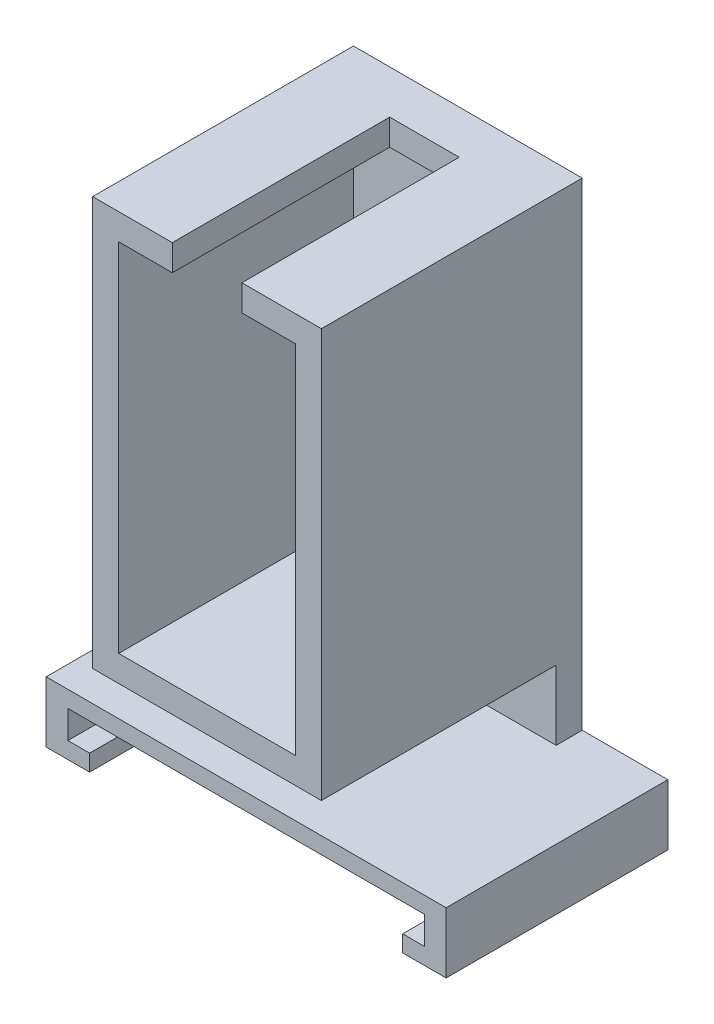
ISO-10303-21;
HEADER;
FILE_DESCRIPTION(('STEP AP214'),'2;1');
FILE_NAME('part.step','',(''),(''),'','','');
FILE_SCHEMA(('AUTOMOTIVE_DESIGN { 1 0 10303 214 1 1 1 1 }'));
ENDSEC;
DATA;
#1=APPLICATION_CONTEXT('core data for automotive mechanical design processes');
#2=APPLICATION_PROTOCOL_DEFINITION('international standard','automotive_design',2000,#1);
#3=PRODUCT_CONTEXT('',#1,'mechanical');
#4=PRODUCT('Part','Part','',(#3));
#5=PRODUCT_RELATED_PRODUCT_CATEGORY('part','',(#4));
#6=PRODUCT_DEFINITION_FORMATION('','',#4);
#7=PRODUCT_DEFINITION_CONTEXT('part definition',#1,'design');
#8=PRODUCT_DEFINITION('design','',#6,#7);
#9=PRODUCT_DEFINITION_SHAPE('','',#8);
#10=(LENGTH_UNIT() NAMED_UNIT(*) SI_UNIT(.MILLI.,.METRE.));
#11=(NAMED_UNIT(*) PLANE_ANGLE_UNIT() SI_UNIT($,.RADIAN.));
#12=(NAMED_UNIT(*) SI_UNIT($,.STERADIAN.) SOLID_ANGLE_UNIT());
#13=UNCERTAINTY_MEASURE_WITH_UNIT(LENGTH_MEASURE(1.E-05),#10,'distance_accuracy_value','');
#14=(GEOMETRIC_REPRESENTATION_CONTEXT(3) GLOBAL_UNCERTAINTY_ASSIGNED_CONTEXT((#13)) GLOBAL_UNIT_ASSIGNED_CONTEXT((#10,
#11,#12)) REPRESENTATION_CONTEXT('',''));
#15=CARTESIAN_POINT('',(0.,0.,0.));
#16=DIRECTION('',(0.,0.,1.));
#17=DIRECTION('',(1.,0.,0.));
#18=AXIS2_PLACEMENT_3D('',#15,#16,#17);
#19=CARTESIAN_POINT('',(0.,-33.4,5.5));
#20=DIRECTION('',(0.,-1.,0.));
#21=DIRECTION('',(0.,0.,-1.));
#22=AXIS2_PLACEMENT_3D('',#19,#20,#21);
#23=PLANE('',#22);
#24=DIRECTION('',(1.,0.,0.));
#25=VECTOR('',#24,1.);
#26=CARTESIAN_POINT('',(23.,-33.4,3.));
#27=LINE('',#26,#25);
#28=CARTESIAN_POINT('',(-20.5,-33.4,3.));
#29=VERTEX_POINT('',#28);
#30=CARTESIAN_POINT('',(20.5,-33.4,3.));
#31=VERTEX_POINT('',#30);
#32=EDGE_CURVE('E428',#29,#31,#27,.T.);
#33=ORIENTED_EDGE('',*,*,#32,.T.);
#34=DIRECTION('',(0.,0.,-1.));
#35=VECTOR('',#34,1.);
#36=CARTESIAN_POINT('',(20.5,-33.4,5.5));
#37=LINE('',#36,#35);
#38=CARTESIAN_POINT('',(20.5,-33.4,25.5));
#39=VERTEX_POINT('',#38);
#40=EDGE_CURVE('E387',#39,#31,#37,.T.);
#41=ORIENTED_EDGE('',*,*,#40,.F.);
#42=DIRECTION('',(1.,0.,0.));
#43=VECTOR('',#42,1.);
#44=CARTESIAN_POINT('',(0.,-33.4,25.5));
#45=LINE('',#44,#43);
#46=CARTESIAN_POINT('',(-20.5,-33.4,25.5));
#47=VERTEX_POINT('',#46);
#48=EDGE_CURVE('E361',#47,#39,#45,.T.);
#49=ORIENTED_EDGE('',*,*,#48,.F.);
#50=DIRECTION('',(0.,0.,-1.));
#51=VECTOR('',#50,1.);
#52=CARTESIAN_POINT('',(-20.5,-33.4,5.5));
#53=LINE('',#52,#51);
#54=EDGE_CURVE('E391',#47,#29,#53,.T.);
#55=ORIENTED_EDGE('',*,*,#54,.T.);
#56=EDGE_LOOP('',(#33,#41,#49,#55));
#57=FACE_BOUND('',#56,.T.);
#58=ADVANCED_FACE('F106',(#57),#23,.T.);
#59=CARTESIAN_POINT('',(0.,0.,3.));
#60=DIRECTION('',(0.,0.,-1.));
#61=DIRECTION('',(-1.,0.,0.));
#62=AXIS2_PLACEMENT_3D('',#59,#60,#61);
#63=PLANE('',#62);
#64=DIRECTION('',(0.,-1.,0.));
#65=VECTOR('',#64,1.);
#66=CARTESIAN_POINT('',(20.5,-36.6,3.));
#67=LINE('',#66,#65);
#68=CARTESIAN_POINT('',(20.5,-36.6,3.));
#69=VERTEX_POINT('',#68);
#70=EDGE_CURVE('E360',#31,#69,#67,.T.);
#71=ORIENTED_EDGE('',*,*,#70,.F.);
#72=ORIENTED_EDGE('',*,*,#32,.F.);
#73=DIRECTION('',(0.,1.,0.));
#74=VECTOR('',#73,1.);
#75=CARTESIAN_POINT('',(-20.5,-33.4,3.));
#76=LINE('',#75,#74);
#77=CARTESIAN_POINT('',(-20.5,-36.6,3.));
#78=VERTEX_POINT('',#77);
#79=EDGE_CURVE('E389',#78,#29,#76,.T.);
#80=ORIENTED_EDGE('',*,*,#79,.F.);
#81=DIRECTION('',(-1.,0.,0.));
#82=VECTOR('',#81,1.);
#83=CARTESIAN_POINT('',(23.,-36.6,3.));
#84=LINE('',#83,#82);
#85=EDGE_CURVE('E424',#69,#78,#84,.T.);
#86=ORIENTED_EDGE('',*,*,#85,.F.);
#87=EDGE_LOOP('',(#71,#72,#80,#86));
#88=FACE_BOUND('',#87,.T.);
#89=ADVANCED_FACE('F571',(#88),#63,.F.);
#90=CARTESIAN_POINT('',(0.,-36.6,5.5));
#91=DIRECTION('',(0.,-1.,0.));
#92=DIRECTION('',(0.,0.,-1.));
#93=AXIS2_PLACEMENT_3D('',#90,#91,#92);
#94=PLANE('',#93);
#95=DIRECTION('',(0.,0.,-1.));
#96=VECTOR('',#95,1.);
#97=CARTESIAN_POINT('',(20.5,-36.6,5.5));
#98=LINE('',#97,#96);
#99=CARTESIAN_POINT('',(20.5,-36.6,25.5));
#100=VERTEX_POINT('',#99);
#101=EDGE_CURVE('E384',#100,#69,#98,.T.);
#102=ORIENTED_EDGE('',*,*,#101,.T.);
#103=ORIENTED_EDGE('',*,*,#85,.T.);
#104=DIRECTION('',(0.,0.,-1.));
#105=VECTOR('',#104,1.);
#106=CARTESIAN_POINT('',(-20.5,-36.6,5.5));
#107=LINE('',#106,#105);
#108=CARTESIAN_POINT('',(-20.5,-36.6,25.5));
#109=VERTEX_POINT('',#108);
#110=EDGE_CURVE('E394',#109,#78,#107,.T.);
#111=ORIENTED_EDGE('',*,*,#110,.F.);
#112=DIRECTION('',(-1.,0.,0.));
#113=VECTOR('',#112,1.);
#114=CARTESIAN_POINT('',(0.,-36.6,25.5));
#115=LINE('',#114,#113);
#116=CARTESIAN_POINT('',(-18.,-36.6,25.5));
#117=VERTEX_POINT('',#116);
#118=EDGE_CURVE('E352',#117,#109,#115,.T.);
#119=ORIENTED_EDGE('',*,*,#118,.F.);
#120=DIRECTION('',(0.,0.,-1.));
#121=VECTOR('',#120,1.);
#122=CARTESIAN_POINT('',(-18.,-36.6,25.5));
#123=LINE('',#122,#121);
#124=CARTESIAN_POINT('',(-18.,-36.6,5.5));
#125=VERTEX_POINT('',#124);
#126=EDGE_CURVE('E355',#117,#125,#123,.T.);
#127=ORIENTED_EDGE('',*,*,#126,.T.);
#128=DIRECTION('',(-1.,0.,0.));
#129=VECTOR('',#128,1.);
#130=CARTESIAN_POINT('',(0.,-36.6,5.5));
#131=LINE('',#130,#129);
#132=CARTESIAN_POINT('',(18.,-36.6,5.5));
#133=VERTEX_POINT('',#132);
#134=EDGE_CURVE('E412',#133,#125,#131,.T.);
#135=ORIENTED_EDGE('',*,*,#134,.F.);
#136=DIRECTION('',(0.,0.,-1.));
#137=VECTOR('',#136,1.);
#138=CARTESIAN_POINT('',(18.,-36.6,25.5));
#139=LINE('',#138,#137);
#140=CARTESIAN_POINT('',(18.,-36.6,25.5));
#141=VERTEX_POINT('',#140);
#142=EDGE_CURVE('E357',#141,#133,#139,.T.);
#143=ORIENTED_EDGE('',*,*,#142,.F.);
#144=DIRECTION('',(-1.,0.,0.));
#145=VECTOR('',#144,1.);
#146=CARTESIAN_POINT('',(0.,-36.6,25.5));
#147=LINE('',#146,#145);
#148=EDGE_CURVE('E367',#100,#141,#147,.T.);
#149=ORIENTED_EDGE('',*,*,#148,.F.);
#150=EDGE_LOOP('',(#102,#103,#111,#119,#127,#135,#143,#149));
#151=FACE_BOUND('',#150,.T.);
#152=ADVANCED_FACE('F558',(#151),#94,.F.);
#153=CARTESIAN_POINT('',(0.,0.,5.));
#154=DIRECTION('',(0.,0.,-1.));
#155=DIRECTION('',(-1.,0.,0.));
#156=AXIS2_PLACEMENT_3D('',#153,#154,#155);
#157=PLANE('',#156);
#158=DIRECTION('',(0.,1.,0.));
#159=VECTOR('',#158,1.);
#160=CARTESIAN_POINT('',(-3.98950253060092,0.,5.));
#161=LINE('',#160,#159);
#162=CARTESIAN_POINT('',(-3.98950253060093,20.5,5.));
#163=VERTEX_POINT('',#162);
#164=CARTESIAN_POINT('',(-3.98950253060092,23.5,5.));
#165=VERTEX_POINT('',#164);
#166=EDGE_CURVE('E398',#163,#165,#161,.T.);
#167=ORIENTED_EDGE('',*,*,#166,.F.);
#168=DIRECTION('',(1.,0.,0.));
#169=VECTOR('',#168,1.);
#170=CARTESIAN_POINT('',(10.155,20.5,5.));
#171=LINE('',#170,#169);
#172=CARTESIAN_POINT('',(4.01049746939907,20.5,5.));
#173=VERTEX_POINT('',#172);
#174=EDGE_CURVE('E458',#163,#173,#171,.T.);
#175=ORIENTED_EDGE('',*,*,#174,.T.);
#176=DIRECTION('',(0.,-1.,0.));
#177=VECTOR('',#176,1.);
#178=CARTESIAN_POINT('',(4.01049746939909,0.,5.));
#179=LINE('',#178,#177);
#180=CARTESIAN_POINT('',(4.01049746939907,23.5,5.));
#181=VERTEX_POINT('',#180);
#182=EDGE_CURVE('E129',#181,#173,#179,.T.);
#183=ORIENTED_EDGE('',*,*,#182,.F.);
#184=DIRECTION('',(1.,0.,0.));
#185=VECTOR('',#184,1.);
#186=CARTESIAN_POINT('',(13.155,23.5,5.));
#187=LINE('',#186,#185);
#188=EDGE_CURVE('E473',#165,#181,#187,.T.);
#189=ORIENTED_EDGE('',*,*,#188,.F.);
#190=EDGE_LOOP('',(#167,#175,#183,#189));
#191=FACE_BOUND('',#190,.T.);
#192=ADVANCED_FACE('F579',(#191),#157,.F.);
#193=CARTESIAN_POINT('',(0.,0.,3.));
#194=DIRECTION('',(0.,0.,-1.));
#195=DIRECTION('',(-1.,0.,0.));
#196=AXIS2_PLACEMENT_3D('',#193,#194,#195);
#197=PLANE('',#196);
#198=DIRECTION('',(0.,1.,0.));
#199=VECTOR('',#198,1.);
#200=CARTESIAN_POINT('',(10.155,-20.5,3.));
#201=LINE('',#200,#199);
#202=CARTESIAN_POINT('',(10.155,-20.5,3.));
#203=VERTEX_POINT('',#202);
#204=CARTESIAN_POINT('',(10.155,20.5,3.));
#205=VERTEX_POINT('',#204);
#206=EDGE_CURVE('E482',#203,#205,#201,.T.);
#207=ORIENTED_EDGE('',*,*,#206,.T.);
#208=DIRECTION('',(-1.,0.,0.));
#209=VECTOR('',#208,1.);
#210=CARTESIAN_POINT('',(-10.155,20.5,3.));
#211=LINE('',#210,#209);
#212=CARTESIAN_POINT('',(-10.155,20.5,3.));
#213=VERTEX_POINT('',#212);
#214=EDGE_CURVE('E487',#205,#213,#211,.T.);
#215=ORIENTED_EDGE('',*,*,#214,.T.);
#216=DIRECTION('',(0.,-1.,0.));
#217=VECTOR('',#216,1.);
#218=CARTESIAN_POINT('',(-10.155,-20.5,3.));
#219=LINE('',#218,#217);
#220=CARTESIAN_POINT('',(-10.155,-20.5,3.));
#221=VERTEX_POINT('',#220);
#222=EDGE_CURVE('E114',#213,#221,#219,.T.);
#223=ORIENTED_EDGE('',*,*,#222,.T.);
#224=DIRECTION('',(1.,0.,0.));
#225=VECTOR('',#224,1.);
#226=CARTESIAN_POINT('',(-10.155,-20.5,3.));
#227=LINE('',#226,#225);
#228=EDGE_CURVE('E12',#221,#203,#227,.T.);
#229=ORIENTED_EDGE('',*,*,#228,.T.);
#230=EDGE_LOOP('',(#207,#215,#223,#229));
#231=FACE_BOUND('',#230,.T.);
#232=ADVANCED_FACE('F492',(#231),#197,.F.);
#233=CARTESIAN_POINT('',(-10.155,20.5,5.));
#234=DIRECTION('',(-1.,0.,0.));
#235=DIRECTION('',(0.,0.,1.));
#236=AXIS2_PLACEMENT_3D('',#233,#234,#235);
#237=PLANE('',#236);
#238=DIRECTION('',(0.,0.,-1.));
#239=VECTOR('',#238,1.);
#240=CARTESIAN_POINT('',(-10.155,-20.5,5.));
#241=LINE('',#240,#239);
#242=CARTESIAN_POINT('',(-10.155,-20.5,30.));
#243=VERTEX_POINT('',#242);
#244=EDGE_CURVE('E462',#243,#221,#241,.T.);
#245=ORIENTED_EDGE('',*,*,#244,.T.);
#246=ORIENTED_EDGE('',*,*,#222,.F.);
#247=DIRECTION('',(0.,0.,-1.));
#248=VECTOR('',#247,1.);
#249=CARTESIAN_POINT('',(-10.155,20.5,5.));
#250=LINE('',#249,#248);
#251=CARTESIAN_POINT('',(-10.155,20.5,30.));
#252=VERTEX_POINT('',#251);
#253=EDGE_CURVE('E461',#252,#213,#250,.T.);
#254=ORIENTED_EDGE('',*,*,#253,.F.);
#255=DIRECTION('',(0.,1.,0.));
#256=VECTOR('',#255,1.);
#257=CARTESIAN_POINT('',(-10.155,0.,30.));
#258=LINE('',#257,#256);
#259=EDGE_CURVE('E322',#243,#252,#258,.T.);
#260=ORIENTED_EDGE('',*,*,#259,.F.);
#261=EDGE_LOOP('',(#245,#246,#254,#260));
#262=FACE_BOUND('',#261,.T.);
#263=ADVANCED_FACE('F494',(#262),#237,.F.);
#264=CARTESIAN_POINT('',(10.155,-20.5,5.));
#265=DIRECTION('',(0.,-1.,0.));
#266=DIRECTION('',(0.,0.,-1.));
#267=AXIS2_PLACEMENT_3D('',#264,#265,#266);
#268=PLANE('',#267);
#269=DIRECTION('',(0.,0.,-1.));
#270=VECTOR('',#269,1.);
#271=CARTESIAN_POINT('',(10.155,-20.5,5.));
#272=LINE('',#271,#270);
#273=CARTESIAN_POINT('',(10.155,-20.5,30.));
#274=VERTEX_POINT('',#273);
#275=EDGE_CURVE('E466',#274,#203,#272,.T.);
#276=ORIENTED_EDGE('',*,*,#275,.T.);
#277=ORIENTED_EDGE('',*,*,#228,.F.);
#278=ORIENTED_EDGE('',*,*,#244,.F.);
#279=DIRECTION('',(-1.,0.,0.));
#280=VECTOR('',#279,1.);
#281=CARTESIAN_POINT('',(0.,-20.5,30.));
#282=LINE('',#281,#280);
#283=EDGE_CURVE('E319',#274,#243,#282,.T.);
#284=ORIENTED_EDGE('',*,*,#283,.F.);
#285=EDGE_LOOP('',(#276,#277,#278,#284));
#286=FACE_BOUND('',#285,.T.);
#287=ADVANCED_FACE('F498',(#286),#268,.F.);
#288=CARTESIAN_POINT('',(10.155,20.5,5.));
#289=DIRECTION('',(1.,0.,0.));
#290=DIRECTION('',(0.,0.,-1.));
#291=AXIS2_PLACEMENT_3D('',#288,#289,#290);
#292=PLANE('',#291);
#293=DIRECTION('',(0.,0.,-1.));
#294=VECTOR('',#293,1.);
#295=CARTESIAN_POINT('',(10.155,20.5,5.));
#296=LINE('',#295,#294);
#297=CARTESIAN_POINT('',(10.155,20.5,30.));
#298=VERTEX_POINT('',#297);
#299=EDGE_CURVE('E469',#298,#205,#296,.T.);
#300=ORIENTED_EDGE('',*,*,#299,.T.);
#301=ORIENTED_EDGE('',*,*,#206,.F.);
#302=ORIENTED_EDGE('',*,*,#275,.F.);
#303=DIRECTION('',(0.,-1.,0.));
#304=VECTOR('',#303,1.);
#305=CARTESIAN_POINT('',(10.155,0.,30.));
#306=LINE('',#305,#304);
#307=EDGE_CURVE('E316',#298,#274,#306,.T.);
#308=ORIENTED_EDGE('',*,*,#307,.F.);
#309=EDGE_LOOP('',(#300,#301,#302,#308));
#310=FACE_BOUND('',#309,.T.);
#311=ADVANCED_FACE('F503',(#310),#292,.F.);
#312=CARTESIAN_POINT('',(10.155,20.5,5.));
#313=DIRECTION('',(0.,1.,0.));
#314=DIRECTION('',(0.,0.,1.));
#315=AXIS2_PLACEMENT_3D('',#312,#313,#314);
#316=PLANE('',#315);
#317=ORIENTED_EDGE('',*,*,#253,.T.);
#318=ORIENTED_EDGE('',*,*,#214,.F.);
#319=ORIENTED_EDGE('',*,*,#299,.F.);
#320=DIRECTION('',(1.,0.,0.));
#321=VECTOR('',#320,1.);
#322=CARTESIAN_POINT('',(0.,20.5,30.));
#323=LINE('',#322,#321);
#324=CARTESIAN_POINT('',(4.01049746939907,20.5,30.));
#325=VERTEX_POINT('',#324);
#326=EDGE_CURVE('E313',#325,#298,#323,.T.);
#327=ORIENTED_EDGE('',*,*,#326,.F.);
#328=DIRECTION('',(0.,0.,-1.));
#329=VECTOR('',#328,1.);
#330=CARTESIAN_POINT('',(4.01049746939907,20.5,10.));
#331=LINE('',#330,#329);
#332=EDGE_CURVE('E407',#325,#173,#331,.T.);
#333=ORIENTED_EDGE('',*,*,#332,.T.);
#334=ORIENTED_EDGE('',*,*,#174,.F.);
#335=DIRECTION('',(0.,0.,-1.));
#336=VECTOR('',#335,1.);
#337=CARTESIAN_POINT('',(-3.98950253060093,20.5,10.));
#338=LINE('',#337,#336);
#339=CARTESIAN_POINT('',(-3.98950253060093,20.5,30.));
#340=VERTEX_POINT('',#339);
#341=EDGE_CURVE('E404',#340,#163,#338,.T.);
#342=ORIENTED_EDGE('',*,*,#341,.F.);
#343=DIRECTION('',(1.,0.,0.));
#344=VECTOR('',#343,1.);
#345=CARTESIAN_POINT('',(0.,20.5,30.));
#346=LINE('',#345,#344);
#347=EDGE_CURVE('E325',#252,#340,#346,.T.);
#348=ORIENTED_EDGE('',*,*,#347,.F.);
#349=EDGE_LOOP('',(#317,#318,#319,#327,#333,#334,#342,#348));
#350=FACE_BOUND('',#349,.T.);
#351=ADVANCED_FACE('F505',(#350),#316,.F.);
#352=CARTESIAN_POINT('',(-13.155,23.5,5.));
#353=DIRECTION('',(-1.,0.,0.));
#354=DIRECTION('',(0.,-1.,0.));
#355=AXIS2_PLACEMENT_3D('',#352,#353,#354);
#356=PLANE('',#355);
#357=DIRECTION('',(0.,1.,0.));
#358=VECTOR('',#357,1.);
#359=CARTESIAN_POINT('',(-13.155,23.5,0.));
#360=LINE('',#359,#358);
#361=CARTESIAN_POINT('',(-13.155,-31.5,0.));
#362=VERTEX_POINT('',#361);
#363=CARTESIAN_POINT('',(-13.155,23.5,0.));
#364=VERTEX_POINT('',#363);
#365=EDGE_CURVE('E465',#362,#364,#360,.T.);
#366=ORIENTED_EDGE('',*,*,#365,.F.);
#367=DIRECTION('',(0.,0.,-1.));
#368=VECTOR('',#367,1.);
#369=CARTESIAN_POINT('',(-13.155,-31.5,3.));
#370=LINE('',#369,#368);
#371=CARTESIAN_POINT('',(-13.155,-31.5,3.));
#372=VERTEX_POINT('',#371);
#373=EDGE_CURVE('E455',#372,#362,#370,.T.);
#374=ORIENTED_EDGE('',*,*,#373,.F.);
#375=DIRECTION('',(0.,-1.,0.));
#376=VECTOR('',#375,1.);
#377=CARTESIAN_POINT('',(-13.155,0.,3.));
#378=LINE('',#377,#376);
#379=CARTESIAN_POINT('',(-13.155,-23.5,3.));
#380=VERTEX_POINT('',#379);
#381=EDGE_CURVE('E442',#380,#372,#378,.T.);
#382=ORIENTED_EDGE('',*,*,#381,.F.);
#383=DIRECTION('',(0.,0.,-1.));
#384=VECTOR('',#383,1.);
#385=CARTESIAN_POINT('',(-13.155,-23.5,5.));
#386=LINE('',#385,#384);
#387=CARTESIAN_POINT('',(-13.155,-23.5,30.));
#388=VERTEX_POINT('',#387);
#389=EDGE_CURVE('E480',#388,#380,#386,.T.);
#390=ORIENTED_EDGE('',*,*,#389,.F.);
#391=DIRECTION('',(0.,-1.,0.));
#392=VECTOR('',#391,1.);
#393=CARTESIAN_POINT('',(-13.155,0.,30.));
#394=LINE('',#393,#392);
#395=CARTESIAN_POINT('',(-13.155,23.5,30.));
#396=VERTEX_POINT('',#395);
#397=EDGE_CURVE('E334',#396,#388,#394,.T.);
#398=ORIENTED_EDGE('',*,*,#397,.F.);
#399=DIRECTION('',(0.,0.,-1.));
#400=VECTOR('',#399,1.);
#401=CARTESIAN_POINT('',(-13.155,23.5,5.));
#402=LINE('',#401,#400);
#403=EDGE_CURVE('E293',#396,#364,#402,.T.);
#404=ORIENTED_EDGE('',*,*,#403,.T.);
#405=EDGE_LOOP('',(#366,#374,#382,#390,#398,#404));
#406=FACE_BOUND('',#405,.T.);
#407=ADVANCED_FACE('F513',(#406),#356,.T.);
#408=CARTESIAN_POINT('',(13.155,-23.5,5.));
#409=DIRECTION('',(0.,-1.,0.));
#410=DIRECTION('',(0.,0.,-1.));
#411=AXIS2_PLACEMENT_3D('',#408,#409,#410);
#412=PLANE('',#411);
#413=DIRECTION('',(-1.,0.,0.));
#414=VECTOR('',#413,1.);
#415=CARTESIAN_POINT('',(0.,-23.5,3.));
#416=LINE('',#415,#414);
#417=CARTESIAN_POINT('',(13.155,-23.5,3.));
#418=VERTEX_POINT('',#417);
#419=EDGE_CURVE('E446',#418,#380,#416,.T.);
#420=ORIENTED_EDGE('',*,*,#419,.F.);
#421=DIRECTION('',(0.,0.,-1.));
#422=VECTOR('',#421,1.);
#423=CARTESIAN_POINT('',(13.155,-23.5,5.));
#424=LINE('',#423,#422);
#425=CARTESIAN_POINT('',(13.155,-23.5,30.));
#426=VERTEX_POINT('',#425);
#427=EDGE_CURVE('E292',#426,#418,#424,.T.);
#428=ORIENTED_EDGE('',*,*,#427,.F.);
#429=DIRECTION('',(1.,0.,0.));
#430=VECTOR('',#429,1.);
#431=CARTESIAN_POINT('',(0.,-23.5,30.));
#432=LINE('',#431,#430);
#433=EDGE_CURVE('E309',#388,#426,#432,.T.);
#434=ORIENTED_EDGE('',*,*,#433,.F.);
#435=ORIENTED_EDGE('',*,*,#389,.T.);
#436=EDGE_LOOP('',(#420,#428,#434,#435));
#437=FACE_BOUND('',#436,.T.);
#438=ADVANCED_FACE('F517',(#437),#412,.T.);
#439=CARTESIAN_POINT('',(13.155,23.5,5.));
#440=DIRECTION('',(1.,0.,0.));
#441=DIRECTION('',(0.,1.,0.));
#442=AXIS2_PLACEMENT_3D('',#439,#440,#441);
#443=PLANE('',#442);
#444=DIRECTION('',(0.,-1.,0.));
#445=VECTOR('',#444,1.);
#446=CARTESIAN_POINT('',(13.155,23.5,0.));
#447=LINE('',#446,#445);
#448=CARTESIAN_POINT('',(13.155,23.5,0.));
#449=VERTEX_POINT('',#448);
#450=CARTESIAN_POINT('',(13.155,-31.5,0.));
#451=VERTEX_POINT('',#450);
#452=EDGE_CURVE('E288',#449,#451,#447,.T.);
#453=ORIENTED_EDGE('',*,*,#452,.F.);
#454=DIRECTION('',(0.,0.,-1.));
#455=VECTOR('',#454,1.);
#456=CARTESIAN_POINT('',(13.155,23.5,5.));
#457=LINE('',#456,#455);
#458=CARTESIAN_POINT('',(13.155,23.5,30.));
#459=VERTEX_POINT('',#458);
#460=EDGE_CURVE('E281',#459,#449,#457,.T.);
#461=ORIENTED_EDGE('',*,*,#460,.F.);
#462=DIRECTION('',(0.,1.,0.));
#463=VECTOR('',#462,1.);
#464=CARTESIAN_POINT('',(13.155,0.,30.));
#465=LINE('',#464,#463);
#466=EDGE_CURVE('E286',#426,#459,#465,.T.);
#467=ORIENTED_EDGE('',*,*,#466,.F.);
#468=ORIENTED_EDGE('',*,*,#427,.T.);
#469=DIRECTION('',(0.,-1.,0.));
#470=VECTOR('',#469,1.);
#471=CARTESIAN_POINT('',(13.155,0.,3.));
#472=LINE('',#471,#470);
#473=CARTESIAN_POINT('',(13.155,-31.5,3.));
#474=VERTEX_POINT('',#473);
#475=EDGE_CURVE('E449',#418,#474,#472,.T.);
#476=ORIENTED_EDGE('',*,*,#475,.T.);
#477=DIRECTION('',(0.,0.,-1.));
#478=VECTOR('',#477,1.);
#479=CARTESIAN_POINT('',(13.155,-31.5,3.));
#480=LINE('',#479,#478);
#481=EDGE_CURVE('E454',#474,#451,#480,.T.);
#482=ORIENTED_EDGE('',*,*,#481,.T.);
#483=EDGE_LOOP('',(#453,#461,#467,#468,#476,#482));
#484=FACE_BOUND('',#483,.T.);
#485=ADVANCED_FACE('F283',(#484),#443,.T.);
#486=CARTESIAN_POINT('',(13.155,23.5,5.));
#487=DIRECTION('',(0.,1.,0.));
#488=DIRECTION('',(0.,0.,1.));
#489=AXIS2_PLACEMENT_3D('',#486,#487,#488);
#490=PLANE('',#489);
#491=DIRECTION('',(1.,0.,0.));
#492=VECTOR('',#491,1.);
#493=CARTESIAN_POINT('',(13.155,23.5,0.));
#494=LINE('',#493,#492);
#495=EDGE_CURVE('E477',#364,#449,#494,.T.);
#496=ORIENTED_EDGE('',*,*,#495,.F.);
#497=ORIENTED_EDGE('',*,*,#403,.F.);
#498=DIRECTION('',(-1.,0.,0.));
#499=VECTOR('',#498,1.);
#500=CARTESIAN_POINT('',(0.,23.5,30.));
#501=LINE('',#500,#499);
#502=CARTESIAN_POINT('',(-3.98950253060093,23.5,30.));
#503=VERTEX_POINT('',#502);
#504=EDGE_CURVE('E331',#503,#396,#501,.T.);
#505=ORIENTED_EDGE('',*,*,#504,.F.);
#506=DIRECTION('',(0.,0.,-1.));
#507=VECTOR('',#506,1.);
#508=CARTESIAN_POINT('',(-3.98950253060093,23.5,10.));
#509=LINE('',#508,#507);
#510=EDGE_CURVE('E401',#503,#165,#509,.T.);
#511=ORIENTED_EDGE('',*,*,#510,.T.);
#512=ORIENTED_EDGE('',*,*,#188,.T.);
#513=DIRECTION('',(0.,0.,-1.));
#514=VECTOR('',#513,1.);
#515=CARTESIAN_POINT('',(4.01049746939907,23.5,10.));
#516=LINE('',#515,#514);
#517=CARTESIAN_POINT('',(4.01049746939907,23.5,30.));
#518=VERTEX_POINT('',#517);
#519=EDGE_CURVE('E299',#518,#181,#516,.T.);
#520=ORIENTED_EDGE('',*,*,#519,.F.);
#521=DIRECTION('',(-1.,0.,0.));
#522=VECTOR('',#521,1.);
#523=CARTESIAN_POINT('',(0.,23.5,30.));
#524=LINE('',#523,#522);
#525=EDGE_CURVE('E296',#459,#518,#524,.T.);
#526=ORIENTED_EDGE('',*,*,#525,.F.);
#527=ORIENTED_EDGE('',*,*,#460,.T.);
#528=EDGE_LOOP('',(#496,#497,#505,#511,#512,#520,#526,#527));
#529=FACE_BOUND('',#528,.T.);
#530=ADVANCED_FACE('F297',(#529),#490,.T.);
#531=CARTESIAN_POINT('',(0.,0.,0.));
#532=DIRECTION('',(0.,0.,-1.));
#533=DIRECTION('',(-1.,0.,0.));
#534=AXIS2_PLACEMENT_3D('',#531,#532,#533);
#535=PLANE('',#534);
#536=ORIENTED_EDGE('',*,*,#365,.T.);
#537=ORIENTED_EDGE('',*,*,#495,.T.);
#538=ORIENTED_EDGE('',*,*,#452,.T.);
#539=DIRECTION('',(-1.,0.,0.));
#540=VECTOR('',#539,1.);
#541=CARTESIAN_POINT('',(0.,-31.5,0.));
#542=LINE('',#541,#540);
#543=CARTESIAN_POINT('',(23.,-31.5,0.));
#544=VERTEX_POINT('',#543);
#545=EDGE_CURVE('E436',#544,#451,#542,.T.);
#546=ORIENTED_EDGE('',*,*,#545,.F.);
#547=DIRECTION('',(0.,-1.,0.));
#548=VECTOR('',#547,1.);
#549=CARTESIAN_POINT('',(23.,0.,0.));
#550=LINE('',#549,#548);
#551=CARTESIAN_POINT('',(23.,-38.5,0.));
#552=VERTEX_POINT('',#551);
#553=EDGE_CURVE('E431',#544,#552,#550,.T.);
#554=ORIENTED_EDGE('',*,*,#553,.T.);
#555=DIRECTION('',(-1.,0.,0.));
#556=VECTOR('',#555,1.);
#557=CARTESIAN_POINT('',(0.,-38.5,0.));
#558=LINE('',#557,#556);
#559=CARTESIAN_POINT('',(-23.,-38.5,0.));
#560=VERTEX_POINT('',#559);
#561=EDGE_CURVE('E411',#552,#560,#558,.T.);
#562=ORIENTED_EDGE('',*,*,#561,.T.);
#563=DIRECTION('',(0.,-1.,0.));
#564=VECTOR('',#563,1.);
#565=CARTESIAN_POINT('',(-23.,0.,0.));
#566=LINE('',#565,#564);
#567=CARTESIAN_POINT('',(-23.,-31.5,0.));
#568=VERTEX_POINT('',#567);
#569=EDGE_CURVE('E433',#568,#560,#566,.T.);
#570=ORIENTED_EDGE('',*,*,#569,.F.);
#571=EDGE_CURVE('E435',#362,#568,#542,.T.);
#572=ORIENTED_EDGE('',*,*,#571,.F.);
#573=EDGE_LOOP('',(#536,#537,#538,#546,#554,#562,#570,#572));
#574=FACE_BOUND('',#573,.T.);
#575=ADVANCED_FACE('F108',(#574),#535,.T.);
#576=CARTESIAN_POINT('',(0.,0.,3.));
#577=DIRECTION('',(0.,0.,-1.));
#578=DIRECTION('',(-1.,0.,0.));
#579=AXIS2_PLACEMENT_3D('',#576,#577,#578);
#580=PLANE('',#579);
#581=ORIENTED_EDGE('',*,*,#381,.T.);
#582=DIRECTION('',(-1.,0.,0.));
#583=VECTOR('',#582,1.);
#584=CARTESIAN_POINT('',(0.,-31.5,3.));
#585=LINE('',#584,#583);
#586=EDGE_CURVE('E451',#474,#372,#585,.T.);
#587=ORIENTED_EDGE('',*,*,#586,.F.);
#588=ORIENTED_EDGE('',*,*,#475,.F.);
#589=ORIENTED_EDGE('',*,*,#419,.T.);
#590=EDGE_LOOP('',(#581,#587,#588,#589));
#591=FACE_BOUND('',#590,.T.);
#592=ADVANCED_FACE('F520',(#591),#580,.F.);
#593=CARTESIAN_POINT('',(23.,0.,5.5));
#594=DIRECTION('',(1.,0.,0.));
#595=DIRECTION('',(0.,0.,-1.));
#596=AXIS2_PLACEMENT_3D('',#593,#594,#595);
#597=PLANE('',#596);
#598=ORIENTED_EDGE('',*,*,#553,.F.);
#599=DIRECTION('',(0.,0.,-1.));
#600=VECTOR('',#599,1.);
#601=CARTESIAN_POINT('',(23.,-31.5,5.5));
#602=LINE('',#601,#600);
#603=CARTESIAN_POINT('',(23.,-31.5,25.5));
#604=VERTEX_POINT('',#603);
#605=EDGE_CURVE('E440',#604,#544,#602,.T.);
#606=ORIENTED_EDGE('',*,*,#605,.F.);
#607=DIRECTION('',(0.,1.,0.));
#608=VECTOR('',#607,1.);
#609=CARTESIAN_POINT('',(23.,0.,25.5));
#610=LINE('',#609,#608);
#611=CARTESIAN_POINT('',(23.,-38.5,25.5));
#612=VERTEX_POINT('',#611);
#613=EDGE_CURVE('E375',#612,#604,#610,.T.);
#614=ORIENTED_EDGE('',*,*,#613,.F.);
#615=DIRECTION('',(0.,0.,-1.));
#616=VECTOR('',#615,1.);
#617=CARTESIAN_POINT('',(23.,-38.5,5.5));
#618=LINE('',#617,#616);
#619=EDGE_CURVE('E418',#612,#552,#618,.T.);
#620=ORIENTED_EDGE('',*,*,#619,.T.);
#621=EDGE_LOOP('',(#598,#606,#614,#620));
#622=FACE_BOUND('',#621,.T.);
#623=ADVANCED_FACE('F530',(#622),#597,.T.);
#624=CARTESIAN_POINT('',(0.,-31.5,5.5));
#625=DIRECTION('',(0.,-1.,0.));
#626=DIRECTION('',(0.,0.,-1.));
#627=AXIS2_PLACEMENT_3D('',#624,#625,#626);
#628=PLANE('',#627);
#629=ORIENTED_EDGE('',*,*,#481,.F.);
#630=ORIENTED_EDGE('',*,*,#586,.T.);
#631=ORIENTED_EDGE('',*,*,#373,.T.);
#632=ORIENTED_EDGE('',*,*,#571,.T.);
#633=DIRECTION('',(0.,0.,-1.));
#634=VECTOR('',#633,1.);
#635=CARTESIAN_POINT('',(-23.,-31.5,5.5));
#636=LINE('',#635,#634);
#637=CARTESIAN_POINT('',(-23.,-31.5,25.5));
#638=VERTEX_POINT('',#637);
#639=EDGE_CURVE('E439',#638,#568,#636,.T.);
#640=ORIENTED_EDGE('',*,*,#639,.F.);
#641=DIRECTION('',(-1.,0.,0.));
#642=VECTOR('',#641,1.);
#643=CARTESIAN_POINT('',(0.,-31.5,25.5));
#644=LINE('',#643,#642);
#645=EDGE_CURVE('E341',#604,#638,#644,.T.);
#646=ORIENTED_EDGE('',*,*,#645,.F.);
#647=ORIENTED_EDGE('',*,*,#605,.T.);
#648=ORIENTED_EDGE('',*,*,#545,.T.);
#649=EDGE_LOOP('',(#629,#630,#631,#632,#640,#646,#647,#648));
#650=FACE_BOUND('',#649,.T.);
#651=ADVANCED_FACE('F525',(#650),#628,.F.);
#652=CARTESIAN_POINT('',(-23.,0.,5.5));
#653=DIRECTION('',(1.,0.,0.));
#654=DIRECTION('',(0.,0.,-1.));
#655=AXIS2_PLACEMENT_3D('',#652,#653,#654);
#656=PLANE('',#655);
#657=DIRECTION('',(0.,0.,-1.));
#658=VECTOR('',#657,1.);
#659=CARTESIAN_POINT('',(-23.,-38.5,5.5));
#660=LINE('',#659,#658);
#661=CARTESIAN_POINT('',(-23.,-38.5,25.5));
#662=VERTEX_POINT('',#661);
#663=EDGE_CURVE('E421',#662,#560,#660,.T.);
#664=ORIENTED_EDGE('',*,*,#663,.F.);
#665=DIRECTION('',(0.,-1.,0.));
#666=VECTOR('',#665,1.);
#667=CARTESIAN_POINT('',(-23.,0.,25.5));
#668=LINE('',#667,#666);
#669=EDGE_CURVE('E345',#638,#662,#668,.T.);
#670=ORIENTED_EDGE('',*,*,#669,.F.);
#671=ORIENTED_EDGE('',*,*,#639,.T.);
#672=ORIENTED_EDGE('',*,*,#569,.T.);
#673=EDGE_LOOP('',(#664,#670,#671,#672));
#674=FACE_BOUND('',#673,.T.);
#675=ADVANCED_FACE('F540',(#674),#656,.F.);
#676=CARTESIAN_POINT('',(0.,0.,5.5));
#677=DIRECTION('',(0.,0.,-1.));
#678=DIRECTION('',(-1.,0.,0.));
#679=AXIS2_PLACEMENT_3D('',#676,#677,#678);
#680=PLANE('',#679);
#681=DIRECTION('',(-1.,0.,0.));
#682=VECTOR('',#681,1.);
#683=CARTESIAN_POINT('',(0.,-38.5,5.5));
#684=LINE('',#683,#682);
#685=CARTESIAN_POINT('',(18.,-38.5,5.5));
#686=VERTEX_POINT('',#685);
#687=CARTESIAN_POINT('',(-18.,-38.5,5.5));
#688=VERTEX_POINT('',#687);
#689=EDGE_CURVE('E415',#686,#688,#684,.T.);
#690=ORIENTED_EDGE('',*,*,#689,.F.);
#691=DIRECTION('',(0.,1.,0.));
#692=VECTOR('',#691,1.);
#693=CARTESIAN_POINT('',(18.,0.,5.5));
#694=LINE('',#693,#692);
#695=EDGE_CURVE('E337',#686,#133,#694,.T.);
#696=ORIENTED_EDGE('',*,*,#695,.T.);
#697=ORIENTED_EDGE('',*,*,#134,.T.);
#698=DIRECTION('',(0.,-1.,0.));
#699=VECTOR('',#698,1.);
#700=CARTESIAN_POINT('',(-18.,0.,5.5));
#701=LINE('',#700,#699);
#702=EDGE_CURVE('E342',#125,#688,#701,.T.);
#703=ORIENTED_EDGE('',*,*,#702,.T.);
#704=EDGE_LOOP('',(#690,#696,#697,#703));
#705=FACE_BOUND('',#704,.T.);
#706=ADVANCED_FACE('F553',(#705),#680,.F.);
#707=CARTESIAN_POINT('',(0.,-38.5,5.5));
#708=DIRECTION('',(0.,-1.,0.));
#709=DIRECTION('',(0.,0.,-1.));
#710=AXIS2_PLACEMENT_3D('',#707,#708,#709);
#711=PLANE('',#710);
#712=ORIENTED_EDGE('',*,*,#561,.F.);
#713=ORIENTED_EDGE('',*,*,#619,.F.);
#714=DIRECTION('',(1.,0.,0.));
#715=VECTOR('',#714,1.);
#716=CARTESIAN_POINT('',(0.,-38.5,25.5));
#717=LINE('',#716,#715);
#718=CARTESIAN_POINT('',(18.,-38.5,25.5));
#719=VERTEX_POINT('',#718);
#720=EDGE_CURVE('E372',#719,#612,#717,.T.);
#721=ORIENTED_EDGE('',*,*,#720,.F.);
#722=DIRECTION('',(0.,0.,-1.));
#723=VECTOR('',#722,1.);
#724=CARTESIAN_POINT('',(18.,-38.5,25.5));
#725=LINE('',#724,#723);
#726=EDGE_CURVE('E378',#719,#686,#725,.T.);
#727=ORIENTED_EDGE('',*,*,#726,.T.);
#728=ORIENTED_EDGE('',*,*,#689,.T.);
#729=DIRECTION('',(0.,0.,-1.));
#730=VECTOR('',#729,1.);
#731=CARTESIAN_POINT('',(-18.,-38.5,25.5));
#732=LINE('',#731,#730);
#733=CARTESIAN_POINT('',(-18.,-38.5,25.5));
#734=VERTEX_POINT('',#733);
#735=EDGE_CURVE('E121',#734,#688,#732,.T.);
#736=ORIENTED_EDGE('',*,*,#735,.F.);
#737=DIRECTION('',(1.,0.,0.));
#738=VECTOR('',#737,1.);
#739=CARTESIAN_POINT('',(0.,-38.5,25.5));
#740=LINE('',#739,#738);
#741=EDGE_CURVE('E348',#662,#734,#740,.T.);
#742=ORIENTED_EDGE('',*,*,#741,.F.);
#743=ORIENTED_EDGE('',*,*,#663,.T.);
#744=EDGE_LOOP('',(#712,#713,#721,#727,#728,#736,#742,#743));
#745=FACE_BOUND('',#744,.T.);
#746=ADVANCED_FACE('F535',(#745),#711,.T.);
#747=CARTESIAN_POINT('',(4.01049746939909,0.,10.));
#748=DIRECTION('',(1.,0.,0.));
#749=DIRECTION('',(0.,1.,0.));
#750=AXIS2_PLACEMENT_3D('',#747,#748,#749);
#751=PLANE('',#750);
#752=ORIENTED_EDGE('',*,*,#182,.T.);
#753=ORIENTED_EDGE('',*,*,#332,.F.);
#754=DIRECTION('',(0.,-1.,0.));
#755=VECTOR('',#754,1.);
#756=CARTESIAN_POINT('',(4.01049746939909,0.,30.));
#757=LINE('',#756,#755);
#758=EDGE_CURVE('E303',#518,#325,#757,.T.);
#759=ORIENTED_EDGE('',*,*,#758,.F.);
#760=ORIENTED_EDGE('',*,*,#519,.T.);
#761=EDGE_LOOP('',(#752,#753,#759,#760));
#762=FACE_BOUND('',#761,.T.);
#763=ADVANCED_FACE('F682',(#762),#751,.F.);
#764=CARTESIAN_POINT('',(-3.98950253060092,0.,10.));
#765=DIRECTION('',(-1.,0.,0.));
#766=DIRECTION('',(0.,-1.,0.));
#767=AXIS2_PLACEMENT_3D('',#764,#765,#766);
#768=PLANE('',#767);
#769=ORIENTED_EDGE('',*,*,#166,.T.);
#770=ORIENTED_EDGE('',*,*,#510,.F.);
#771=DIRECTION('',(0.,1.,0.));
#772=VECTOR('',#771,1.);
#773=CARTESIAN_POINT('',(-3.98950253060092,0.,30.));
#774=LINE('',#773,#772);
#775=EDGE_CURVE('E328',#340,#503,#774,.T.);
#776=ORIENTED_EDGE('',*,*,#775,.F.);
#777=ORIENTED_EDGE('',*,*,#341,.T.);
#778=EDGE_LOOP('',(#769,#770,#776,#777));
#779=FACE_BOUND('',#778,.T.);
#780=ADVANCED_FACE('F510',(#779),#768,.F.);
#781=CARTESIAN_POINT('',(-20.5,-33.4,5.5));
#782=DIRECTION('',(-1.,0.,0.));
#783=DIRECTION('',(0.,0.,1.));
#784=AXIS2_PLACEMENT_3D('',#781,#782,#783);
#785=PLANE('',#784);
#786=ORIENTED_EDGE('',*,*,#79,.T.);
#787=ORIENTED_EDGE('',*,*,#54,.F.);
#788=DIRECTION('',(0.,-1.,0.));
#789=VECTOR('',#788,1.);
#790=CARTESIAN_POINT('',(-20.5,0.,25.5));
#791=LINE('',#790,#789);
#792=EDGE_CURVE('E338',#47,#109,#791,.T.);
#793=ORIENTED_EDGE('',*,*,#792,.T.);
#794=ORIENTED_EDGE('',*,*,#110,.T.);
#795=EDGE_LOOP('',(#786,#787,#793,#794));
#796=FACE_BOUND('',#795,.T.);
#797=ADVANCED_FACE('F562',(#796),#785,.F.);
#798=CARTESIAN_POINT('',(20.5,-36.6,5.5));
#799=DIRECTION('',(1.,0.,0.));
#800=DIRECTION('',(0.,0.,-1.));
#801=AXIS2_PLACEMENT_3D('',#798,#799,#800);
#802=PLANE('',#801);
#803=ORIENTED_EDGE('',*,*,#70,.T.);
#804=ORIENTED_EDGE('',*,*,#101,.F.);
#805=DIRECTION('',(0.,-1.,0.));
#806=VECTOR('',#805,1.);
#807=CARTESIAN_POINT('',(20.5,0.,25.5));
#808=LINE('',#807,#806);
#809=EDGE_CURVE('E364',#39,#100,#808,.T.);
#810=ORIENTED_EDGE('',*,*,#809,.F.);
#811=ORIENTED_EDGE('',*,*,#40,.T.);
#812=EDGE_LOOP('',(#803,#804,#810,#811));
#813=FACE_BOUND('',#812,.T.);
#814=ADVANCED_FACE('F568',(#813),#802,.F.);
#815=CARTESIAN_POINT('',(-18.,0.,25.5));
#816=DIRECTION('',(1.,0.,0.));
#817=DIRECTION('',(0.,0.,-1.));
#818=AXIS2_PLACEMENT_3D('',#815,#816,#817);
#819=PLANE('',#818);
#820=ORIENTED_EDGE('',*,*,#702,.F.);
#821=ORIENTED_EDGE('',*,*,#126,.F.);
#822=DIRECTION('',(0.,-1.,0.));
#823=VECTOR('',#822,1.);
#824=CARTESIAN_POINT('',(-18.,0.,25.5));
#825=LINE('',#824,#823);
#826=EDGE_CURVE('E350',#117,#734,#825,.T.);
#827=ORIENTED_EDGE('',*,*,#826,.T.);
#828=ORIENTED_EDGE('',*,*,#735,.T.);
#829=EDGE_LOOP('',(#820,#821,#827,#828));
#830=FACE_BOUND('',#829,.T.);
#831=ADVANCED_FACE('F554',(#830),#819,.T.);
#832=CARTESIAN_POINT('',(0.,0.,25.5));
#833=DIRECTION('',(0.,0.,1.));
#834=DIRECTION('',(1.,0.,0.));
#835=AXIS2_PLACEMENT_3D('',#832,#833,#834);
#836=PLANE('',#835);
#837=ORIENTED_EDGE('',*,*,#792,.F.);
#838=ORIENTED_EDGE('',*,*,#48,.T.);
#839=ORIENTED_EDGE('',*,*,#809,.T.);
#840=ORIENTED_EDGE('',*,*,#148,.T.);
#841=DIRECTION('',(0.,1.,0.));
#842=VECTOR('',#841,1.);
#843=CARTESIAN_POINT('',(18.,0.,25.5));
#844=LINE('',#843,#842);
#845=EDGE_CURVE('E369',#719,#141,#844,.T.);
#846=ORIENTED_EDGE('',*,*,#845,.F.);
#847=ORIENTED_EDGE('',*,*,#720,.T.);
#848=ORIENTED_EDGE('',*,*,#613,.T.);
#849=ORIENTED_EDGE('',*,*,#645,.T.);
#850=ORIENTED_EDGE('',*,*,#669,.T.);
#851=ORIENTED_EDGE('',*,*,#741,.T.);
#852=ORIENTED_EDGE('',*,*,#826,.F.);
#853=ORIENTED_EDGE('',*,*,#118,.T.);
#854=EDGE_LOOP('',(#837,#838,#839,#840,#846,#847,#848,#849,#850,#851,#852,#853));
#855=FACE_BOUND('',#854,.T.);
#856=ADVANCED_FACE('F544',(#855),#836,.T.);
#857=CARTESIAN_POINT('',(18.,0.,25.5));
#858=DIRECTION('',(-1.,0.,0.));
#859=DIRECTION('',(0.,0.,1.));
#860=AXIS2_PLACEMENT_3D('',#857,#858,#859);
#861=PLANE('',#860);
#862=ORIENTED_EDGE('',*,*,#695,.F.);
#863=ORIENTED_EDGE('',*,*,#726,.F.);
#864=ORIENTED_EDGE('',*,*,#845,.T.);
#865=ORIENTED_EDGE('',*,*,#142,.T.);
#866=EDGE_LOOP('',(#862,#863,#864,#865));
#867=FACE_BOUND('',#866,.T.);
#868=ADVANCED_FACE('F549',(#867),#861,.T.);
#869=CARTESIAN_POINT('',(0.,0.,30.));
#870=DIRECTION('',(0.,0.,1.));
#871=DIRECTION('',(1.,0.,0.));
#872=AXIS2_PLACEMENT_3D('',#869,#870,#871);
#873=PLANE('',#872);
#874=ORIENTED_EDGE('',*,*,#466,.T.);
#875=ORIENTED_EDGE('',*,*,#525,.T.);
#876=ORIENTED_EDGE('',*,*,#758,.T.);
#877=ORIENTED_EDGE('',*,*,#326,.T.);
#878=ORIENTED_EDGE('',*,*,#307,.T.);
#879=ORIENTED_EDGE('',*,*,#283,.T.);
#880=ORIENTED_EDGE('',*,*,#259,.T.);
#881=ORIENTED_EDGE('',*,*,#347,.T.);
#882=ORIENTED_EDGE('',*,*,#775,.T.);
#883=ORIENTED_EDGE('',*,*,#504,.T.);
#884=ORIENTED_EDGE('',*,*,#397,.T.);
#885=ORIENTED_EDGE('',*,*,#433,.T.);
#886=EDGE_LOOP('',(#874,#875,#876,#877,#878,#879,#880,#881,#882,#883,#884,#885));
#887=FACE_BOUND('',#886,.T.);
#888=ADVANCED_FACE('F306',(#887),#873,.T.);
#889=CLOSED_SHELL('',(#58,#89,#152,#192,#232,#263,#287,#311,#351,#407,#438,#485,#530,#575,#592,
#623,#651,#675,#706,#746,#763,#780,#797,#814,#831,#856,#868,#888));
#890=MANIFOLD_SOLID_BREP('B2',#889);
#891=ADVANCED_BREP_SHAPE_REPRESENTATION('',(#18,#890),#14);
#892=SHAPE_DEFINITION_REPRESENTATION(#9,#891);
ENDSEC;
END-ISO-10303-21;
